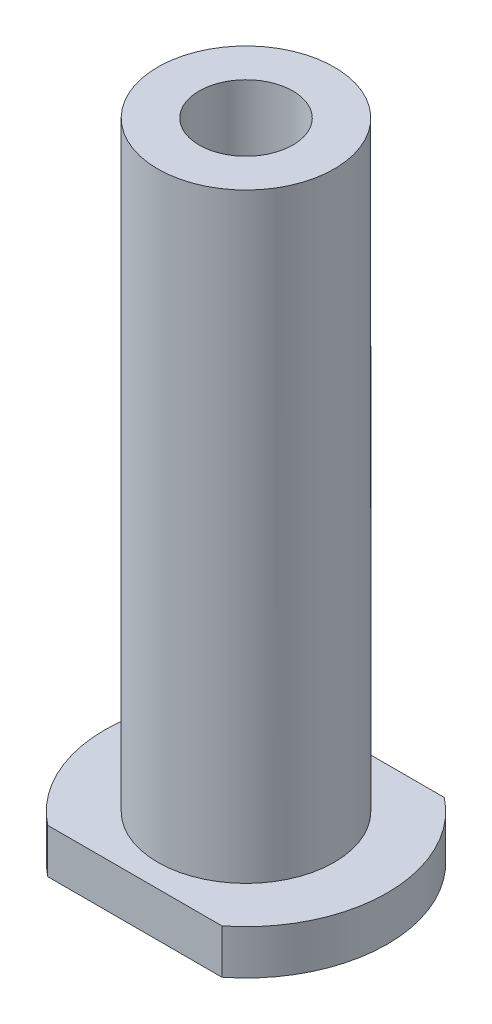
ISO-10303-21;
HEADER;
FILE_DESCRIPTION(('STEP AP214'),'2;1');
FILE_NAME('part.step','',(''),(''),'','','');
FILE_SCHEMA(('AUTOMOTIVE_DESIGN { 1 0 10303 214 1 1 1 1 }'));
ENDSEC;
DATA;
#1=APPLICATION_CONTEXT('core data for automotive mechanical design processes');
#2=APPLICATION_PROTOCOL_DEFINITION('international standard','automotive_design',2000,#1);
#3=PRODUCT_CONTEXT('',#1,'mechanical');
#4=PRODUCT('Part','Part','',(#3));
#5=PRODUCT_RELATED_PRODUCT_CATEGORY('part','',(#4));
#6=PRODUCT_DEFINITION_FORMATION('','',#4);
#7=PRODUCT_DEFINITION_CONTEXT('part definition',#1,'design');
#8=PRODUCT_DEFINITION('design','',#6,#7);
#9=PRODUCT_DEFINITION_SHAPE('','',#8);
#10=(LENGTH_UNIT() NAMED_UNIT(*) SI_UNIT(.MILLI.,.METRE.));
#11=(NAMED_UNIT(*) PLANE_ANGLE_UNIT() SI_UNIT($,.RADIAN.));
#12=(NAMED_UNIT(*) SI_UNIT($,.STERADIAN.) SOLID_ANGLE_UNIT());
#13=UNCERTAINTY_MEASURE_WITH_UNIT(LENGTH_MEASURE(1.E-05),#10,'distance_accuracy_value','');
#14=(GEOMETRIC_REPRESENTATION_CONTEXT(3) GLOBAL_UNCERTAINTY_ASSIGNED_CONTEXT((#13)) GLOBAL_UNIT_ASSIGNED_CONTEXT((#10,
#11,#12)) REPRESENTATION_CONTEXT('',''));
#15=CARTESIAN_POINT('',(0.,0.,0.));
#16=DIRECTION('',(0.,0.,1.));
#17=DIRECTION('',(1.,0.,0.));
#18=AXIS2_PLACEMENT_3D('',#15,#16,#17);
#19=CARTESIAN_POINT('',(1.94289029309402E-13,-54.,6.66133814775094E-13));
#20=DIRECTION('',(0.,1.,0.));
#21=DIRECTION('',(0.,0.,1.));
#22=AXIS2_PLACEMENT_3D('',#19,#20,#21);
#23=CYLINDRICAL_SURFACE('',#22,7.9375);
#24=CARTESIAN_POINT('',(1.94289029309402E-13,-54.,6.66133814775094E-13));
#25=DIRECTION('',(0.,-1.,0.));
#26=DIRECTION('',(0.,0.,-1.));
#27=AXIS2_PLACEMENT_3D('',#24,#25,#26);
#28=CIRCLE('',#27,7.9375);
#29=CARTESIAN_POINT('',(1.94289029309402E-13,-54.,-7.93749999999933));
#30=VERTEX_POINT('',#29);
#31=EDGE_CURVE('E49',#30,#30,#28,.F.);
#32=ORIENTED_EDGE('',*,*,#31,.T.);
#33=EDGE_LOOP('',(#32));
#34=FACE_BOUND('',#33,.T.);
#35=CARTESIAN_POINT('',(0.,0.,0.));
#36=DIRECTION('',(0.,1.,0.));
#37=DIRECTION('',(0.,0.,1.));
#38=AXIS2_PLACEMENT_3D('',#35,#36,#37);
#39=CIRCLE('',#38,7.9375);
#40=CARTESIAN_POINT('',(0.,0.,7.9375));
#41=VERTEX_POINT('',#40);
#42=EDGE_CURVE('E11',#41,#41,#39,.T.);
#43=ORIENTED_EDGE('',*,*,#42,.F.);
#44=EDGE_LOOP('',(#43));
#45=FACE_BOUND('',#44,.T.);
#46=ADVANCED_FACE('F41',(#34,#45),#23,.T.);
#47=CARTESIAN_POINT('',(0.,0.,0.));
#48=DIRECTION('',(0.,1.,0.));
#49=DIRECTION('',(0.,0.,1.));
#50=AXIS2_PLACEMENT_3D('',#47,#48,#49);
#51=PLANE('',#50);
#52=CARTESIAN_POINT('',(0.,0.,0.));
#53=DIRECTION('',(0.,1.,0.));
#54=DIRECTION('',(0.,0.,1.));
#55=AXIS2_PLACEMENT_3D('',#52,#53,#54);
#56=CIRCLE('',#55,4.21639999999999);
#57=CARTESIAN_POINT('',(0.,0.,4.21639999999999));
#58=VERTEX_POINT('',#57);
#59=EDGE_CURVE('E104',#58,#58,#56,.T.);
#60=ORIENTED_EDGE('',*,*,#59,.F.);
#61=EDGE_LOOP('',(#60));
#62=FACE_BOUND('',#61,.T.);
#63=ORIENTED_EDGE('',*,*,#42,.T.);
#64=EDGE_LOOP('',(#63));
#65=FACE_BOUND('',#64,.T.);
#66=ADVANCED_FACE('F153',(#62,#65),#51,.T.);
#67=CARTESIAN_POINT('',(-1.66533453693773E-13,-58.0000000000002,6.66133814775094E-13));
#68=DIRECTION('',(0.,1.,0.));
#69=DIRECTION('',(0.,0.,1.));
#70=AXIS2_PLACEMENT_3D('',#67,#68,#69);
#71=CYLINDRICAL_SURFACE('',#70,12.7);
#72=CARTESIAN_POINT('',(1.94289029309402E-13,-54.,6.66133814775094E-13));
#73=DIRECTION('',(0.,-1.,0.));
#74=DIRECTION('',(0.,0.,-1.));
#75=AXIS2_PLACEMENT_3D('',#72,#73,#74);
#76=CIRCLE('',#75,12.7);
#77=CARTESIAN_POINT('',(-7.82879301041983,-53.9999999999999,9.99999999999979));
#78=VERTEX_POINT('',#77);
#79=CARTESIAN_POINT('',(-7.82879301041989,-54.,-10.0000000000002));
#80=VERTEX_POINT('',#79);
#81=EDGE_CURVE('E103',#78,#80,#76,.T.);
#82=ORIENTED_EDGE('',*,*,#81,.T.);
#83=DIRECTION('',(0.,1.,0.));
#84=VECTOR('',#83,1.);
#85=CARTESIAN_POINT('',(-7.82879301041997,-57.9999999999997,-10.0000000000002));
#86=LINE('',#85,#84);
#87=CARTESIAN_POINT('',(-7.82879301041997,-57.9999999999997,-10.0000000000002));
#88=VERTEX_POINT('',#87);
#89=EDGE_CURVE('E127',#88,#80,#86,.T.);
#90=ORIENTED_EDGE('',*,*,#89,.F.);
#91=CARTESIAN_POINT('',(-1.66533453693773E-13,-58.0000000000002,6.66133814775094E-13));
#92=DIRECTION('',(0.,-1.,0.));
#93=DIRECTION('',(0.,0.,-1.));
#94=AXIS2_PLACEMENT_3D('',#91,#92,#93);
#95=CIRCLE('',#94,12.7);
#96=CARTESIAN_POINT('',(-7.82879301041986,-57.9999999999998,9.99999999999979));
#97=VERTEX_POINT('',#96);
#98=EDGE_CURVE('E112',#97,#88,#95,.T.);
#99=ORIENTED_EDGE('',*,*,#98,.F.);
#100=DIRECTION('',(0.,1.,0.));
#101=VECTOR('',#100,1.);
#102=CARTESIAN_POINT('',(-7.82879301041986,-57.9999999999998,9.99999999999979));
#103=LINE('',#102,#101);
#104=EDGE_CURVE('E117',#97,#78,#103,.T.);
#105=ORIENTED_EDGE('',*,*,#104,.T.);
#106=EDGE_LOOP('',(#82,#90,#99,#105));
#107=FACE_BOUND('',#106,.T.);
#108=ADVANCED_FACE('F140',(#107),#71,.T.);
#109=CARTESIAN_POINT('',(-7.82879301041997,-57.9999999999997,-10.0000000000002));
#110=DIRECTION('',(0.,0.,1.));
#111=DIRECTION('',(1.,0.,0.));
#112=AXIS2_PLACEMENT_3D('',#109,#110,#111);
#113=PLANE('',#112);
#114=DIRECTION('',(1.,0.,0.));
#115=VECTOR('',#114,1.);
#116=CARTESIAN_POINT('',(-7.82879301041989,-54.,-10.0000000000002));
#117=LINE('',#116,#115);
#118=CARTESIAN_POINT('',(7.82879301042008,-54.,-9.99999999999956));
#119=VERTEX_POINT('',#118);
#120=EDGE_CURVE('E107',#80,#119,#117,.T.);
#121=ORIENTED_EDGE('',*,*,#120,.T.);
#122=DIRECTION('',(0.,1.,0.));
#123=VECTOR('',#122,1.);
#124=CARTESIAN_POINT('',(7.82879301041983,-58.0000000000002,-10.));
#125=LINE('',#124,#123);
#126=CARTESIAN_POINT('',(7.82879301041983,-58.0000000000002,-10.));
#127=VERTEX_POINT('',#126);
#128=EDGE_CURVE('E125',#127,#119,#125,.T.);
#129=ORIENTED_EDGE('',*,*,#128,.F.);
#130=DIRECTION('',(1.,0.,0.));
#131=VECTOR('',#130,1.);
#132=CARTESIAN_POINT('',(-7.82879301041997,-57.9999999999997,-10.0000000000002));
#133=LINE('',#132,#131);
#134=EDGE_CURVE('E89',#88,#127,#133,.T.);
#135=ORIENTED_EDGE('',*,*,#134,.F.);
#136=ORIENTED_EDGE('',*,*,#89,.T.);
#137=EDGE_LOOP('',(#121,#129,#135,#136));
#138=FACE_BOUND('',#137,.T.);
#139=ADVANCED_FACE('F145',(#138),#113,.F.);
#140=CARTESIAN_POINT('',(-1.66533453693773E-13,-58.0000000000002,6.66133814775094E-13));
#141=DIRECTION('',(0.,1.,0.));
#142=DIRECTION('',(0.,0.,1.));
#143=AXIS2_PLACEMENT_3D('',#140,#141,#142);
#144=CYLINDRICAL_SURFACE('',#143,12.7);
#145=CARTESIAN_POINT('',(1.94289029309402E-13,-54.,6.66133814775094E-13));
#146=DIRECTION('',(0.,-1.,0.));
#147=DIRECTION('',(0.,0.,-1.));
#148=AXIS2_PLACEMENT_3D('',#145,#146,#147);
#149=CIRCLE('',#148,12.7);
#150=CARTESIAN_POINT('',(7.82879301041986,-54.,10.));
#151=VERTEX_POINT('',#150);
#152=EDGE_CURVE('E75',#119,#151,#149,.T.);
#153=ORIENTED_EDGE('',*,*,#152,.T.);
#154=DIRECTION('',(0.,1.,0.));
#155=VECTOR('',#154,1.);
#156=CARTESIAN_POINT('',(7.82879301042011,-58.,10.0000000000007));
#157=LINE('',#156,#155);
#158=CARTESIAN_POINT('',(7.82879301042011,-58.,10.0000000000007));
#159=VERTEX_POINT('',#158);
#160=EDGE_CURVE('E123',#159,#151,#157,.T.);
#161=ORIENTED_EDGE('',*,*,#160,.F.);
#162=CARTESIAN_POINT('',(-1.66533453693773E-13,-58.0000000000002,6.66133814775094E-13));
#163=DIRECTION('',(0.,-1.,0.));
#164=DIRECTION('',(0.,0.,-1.));
#165=AXIS2_PLACEMENT_3D('',#162,#163,#164);
#166=CIRCLE('',#165,12.7);
#167=EDGE_CURVE('E115',#127,#159,#166,.T.);
#168=ORIENTED_EDGE('',*,*,#167,.F.);
#169=ORIENTED_EDGE('',*,*,#128,.T.);
#170=EDGE_LOOP('',(#153,#161,#168,#169));
#171=FACE_BOUND('',#170,.T.);
#172=ADVANCED_FACE('F144',(#171),#144,.T.);
#173=CARTESIAN_POINT('',(-7.82879301041986,-57.9999999999998,9.99999999999979));
#174=DIRECTION('',(0.,0.,-1.));
#175=DIRECTION('',(-1.,0.,0.));
#176=AXIS2_PLACEMENT_3D('',#173,#174,#175);
#177=PLANE('',#176);
#178=DIRECTION('',(-1.,0.,0.));
#179=VECTOR('',#178,1.);
#180=CARTESIAN_POINT('',(-7.82879301041983,-53.9999999999999,9.99999999999979));
#181=LINE('',#180,#179);
#182=EDGE_CURVE('E81',#151,#78,#181,.T.);
#183=ORIENTED_EDGE('',*,*,#182,.T.);
#184=ORIENTED_EDGE('',*,*,#104,.F.);
#185=DIRECTION('',(-1.,0.,0.));
#186=VECTOR('',#185,1.);
#187=CARTESIAN_POINT('',(-7.82879301041986,-57.9999999999998,9.99999999999979));
#188=LINE('',#187,#186);
#189=EDGE_CURVE('E57',#159,#97,#188,.T.);
#190=ORIENTED_EDGE('',*,*,#189,.F.);
#191=ORIENTED_EDGE('',*,*,#160,.T.);
#192=EDGE_LOOP('',(#183,#184,#190,#191));
#193=FACE_BOUND('',#192,.T.);
#194=ADVANCED_FACE('F142',(#193),#177,.F.);
#195=CARTESIAN_POINT('',(-1.66533453693773E-13,-58.0000000000002,6.66133814775094E-13));
#196=DIRECTION('',(0.,-1.,0.));
#197=DIRECTION('',(0.,0.,-1.));
#198=AXIS2_PLACEMENT_3D('',#195,#196,#197);
#199=PLANE('',#198);
#200=ORIENTED_EDGE('',*,*,#98,.T.);
#201=ORIENTED_EDGE('',*,*,#134,.T.);
#202=ORIENTED_EDGE('',*,*,#167,.T.);
#203=ORIENTED_EDGE('',*,*,#189,.T.);
#204=EDGE_LOOP('',(#200,#201,#202,#203));
#205=FACE_BOUND('',#204,.T.);
#206=ADVANCED_FACE('F135',(#205),#199,.T.);
#207=CARTESIAN_POINT('',(1.94289029309402E-13,-54.,6.66133814775094E-13));
#208=DIRECTION('',(0.,-1.,0.));
#209=DIRECTION('',(0.,0.,-1.));
#210=AXIS2_PLACEMENT_3D('',#207,#208,#209);
#211=PLANE('',#210);
#212=ORIENTED_EDGE('',*,*,#31,.F.);
#213=EDGE_LOOP('',(#212));
#214=FACE_BOUND('',#213,.T.);
#215=ORIENTED_EDGE('',*,*,#81,.F.);
#216=ORIENTED_EDGE('',*,*,#182,.F.);
#217=ORIENTED_EDGE('',*,*,#152,.F.);
#218=ORIENTED_EDGE('',*,*,#120,.F.);
#219=EDGE_LOOP('',(#215,#216,#217,#218));
#220=FACE_BOUND('',#219,.T.);
#221=ADVANCED_FACE('F97',(#214,#220),#211,.F.);
#222=CARTESIAN_POINT('',(0.,-24.3499999999999,0.));
#223=DIRECTION('',(0.,1.,0.));
#224=DIRECTION('',(0.,0.,1.));
#225=AXIS2_PLACEMENT_3D('',#222,#223,#224);
#226=CONICAL_SURFACE('',#225,4.21639999999999,1.02974425867665);
#227=CARTESIAN_POINT('',(2.77555756156289E-13,-26.8834687140675,6.66133814775094E-13));
#228=VERTEX_POINT('',#227);
#229=VERTEX_LOOP('',#228);
#230=FACE_BOUND('',#229,.T.);
#231=CARTESIAN_POINT('',(0.,-24.3499999999999,0.));
#232=DIRECTION('',(0.,1.,0.));
#233=DIRECTION('',(0.,0.,1.));
#234=AXIS2_PLACEMENT_3D('',#231,#232,#233);
#235=CIRCLE('',#234,4.21639999999999);
#236=CARTESIAN_POINT('',(0.,-24.3499999999999,4.21639999999999));
#237=VERTEX_POINT('',#236);
#238=EDGE_CURVE('E101',#237,#237,#235,.T.);
#239=ORIENTED_EDGE('',*,*,#238,.T.);
#240=EDGE_LOOP('',(#239));
#241=FACE_BOUND('',#240,.T.);
#242=ADVANCED_FACE('F93',(#230,#241),#226,.F.);
#243=CARTESIAN_POINT('',(0.,0.,0.));
#244=DIRECTION('',(0.,1.,0.));
#245=DIRECTION('',(0.,0.,1.));
#246=AXIS2_PLACEMENT_3D('',#243,#244,#245);
#247=CYLINDRICAL_SURFACE('',#246,4.21639999999999);
#248=ORIENTED_EDGE('',*,*,#238,.F.);
#249=EDGE_LOOP('',(#248));
#250=FACE_BOUND('',#249,.T.);
#251=ORIENTED_EDGE('',*,*,#59,.T.);
#252=EDGE_LOOP('',(#251));
#253=FACE_BOUND('',#252,.T.);
#254=ADVANCED_FACE('F96',(#250,#253),#247,.F.);
#255=CLOSED_SHELL('',(#46,#66,#108,#139,#172,#194,#206,#221,#242,#254));
#256=MANIFOLD_SOLID_BREP('B2',#255);
#257=ADVANCED_BREP_SHAPE_REPRESENTATION('',(#18,#256),#14);
#258=SHAPE_DEFINITION_REPRESENTATION(#9,#257);
ENDSEC;
END-ISO-10303-21;
